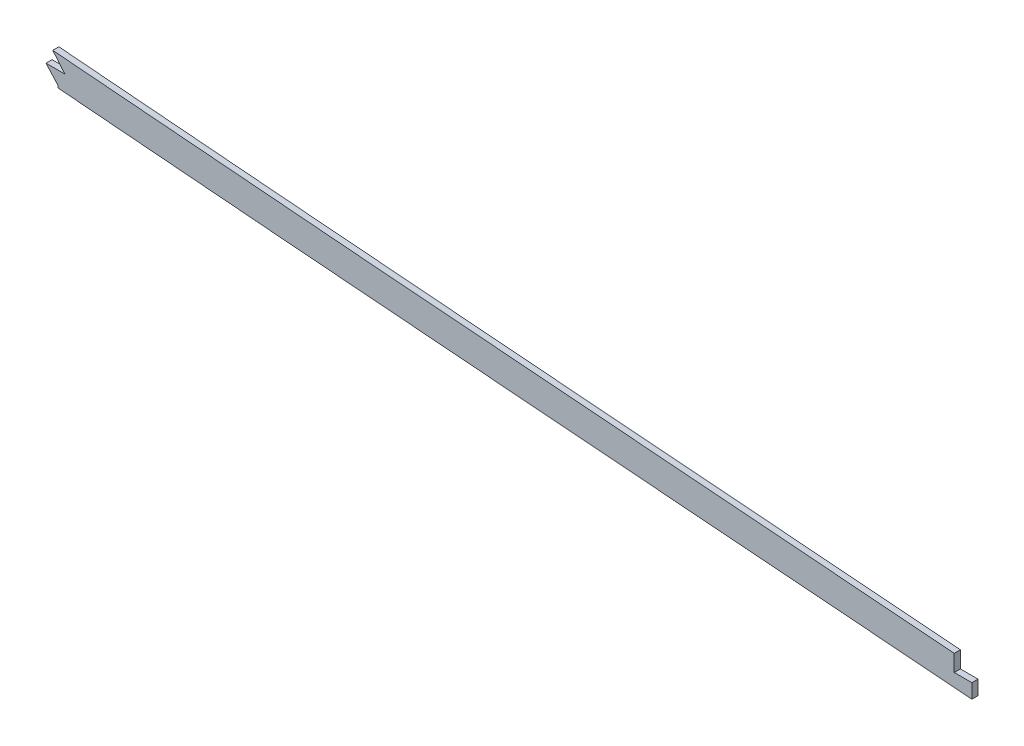
ISO-10303-21;
HEADER;
FILE_DESCRIPTION(('STEP AP214'),'2;1');
FILE_NAME('part.step','',(''),(''),'','','');
FILE_SCHEMA(('AUTOMOTIVE_DESIGN { 1 0 10303 214 1 1 1 1 }'));
ENDSEC;
DATA;
#1=APPLICATION_CONTEXT('core data for automotive mechanical design processes');
#2=APPLICATION_PROTOCOL_DEFINITION('international standard','automotive_design',2000,#1);
#3=PRODUCT_CONTEXT('',#1,'mechanical');
#4=PRODUCT('Part','Part','',(#3));
#5=PRODUCT_RELATED_PRODUCT_CATEGORY('part','',(#4));
#6=PRODUCT_DEFINITION_FORMATION('','',#4);
#7=PRODUCT_DEFINITION_CONTEXT('part definition',#1,'design');
#8=PRODUCT_DEFINITION('design','',#6,#7);
#9=PRODUCT_DEFINITION_SHAPE('','',#8);
#10=(LENGTH_UNIT() NAMED_UNIT(*) SI_UNIT(.MILLI.,.METRE.));
#11=(NAMED_UNIT(*) PLANE_ANGLE_UNIT() SI_UNIT($,.RADIAN.));
#12=(NAMED_UNIT(*) SI_UNIT($,.STERADIAN.) SOLID_ANGLE_UNIT());
#13=UNCERTAINTY_MEASURE_WITH_UNIT(LENGTH_MEASURE(1.E-05),#10,'distance_accuracy_value','');
#14=(GEOMETRIC_REPRESENTATION_CONTEXT(3) GLOBAL_UNCERTAINTY_ASSIGNED_CONTEXT((#13)) GLOBAL_UNIT_ASSIGNED_CONTEXT((#10,
#11,#12)) REPRESENTATION_CONTEXT('',''));
#15=CARTESIAN_POINT('',(0.,0.,0.));
#16=DIRECTION('',(0.,0.,1.));
#17=DIRECTION('',(1.,0.,0.));
#18=AXIS2_PLACEMENT_3D('',#15,#16,#17);
#19=CARTESIAN_POINT('',(818.067033698442,264.706491743222,1.5875));
#20=CARTESIAN_POINT('',(827.043059883077,263.499182154688,1.5875));
#21=CARTESIAN_POINT('',(836.029088262746,262.37336018535,1.5875));
#22=CARTESIAN_POINT('',(845.086758911477,261.305822737124,1.5875));
#23=CARTESIAN_POINT('',(891.386485356828,256.087047064925,1.5875));
#24=CARTESIAN_POINT('',(937.686211733138,251.779150949417,1.5875));
#25=CARTESIAN_POINT('',(973.452075064018,248.227669424888,1.5875));
#26=CARTESIAN_POINT('',(1071.94667214103,239.051054037575,1.5875));
#27=CARTESIAN_POINT('',(1170.4412693194,229.731506737662,1.5875));
#28=CARTESIAN_POINT('',(1231.79194034372,224.503945812963,1.5875));
#29=CARTESIAN_POINT('',(1324.89933614602,216.790627817024,1.5875));
#30=CARTESIAN_POINT('',(1418.00673093479,209.040117977579,1.5875));
#31=CARTESIAN_POINT('',(1449.7429359212,206.361809936344,1.5875));
#32=CARTESIAN_POINT('',(1636.92860677809,190.521130341518,1.5875));
#33=CARTESIAN_POINT('',(1824.11427763497,175.409157235081,1.5875));
#34=CARTESIAN_POINT('',(1979.96694737597,164.299650252625,1.5875));
#35=CARTESIAN_POINT('',(2156.26863942885,150.414433314205,1.5875));
#36=CARTESIAN_POINT('',(2332.5703304682,133.85721640186,1.5875));
#37=CARTESIAN_POINT('',(2354.21298315715,131.785082220072,1.5875));
#38=CARTESIAN_POINT('',(2436.3555443117,123.723952135345,1.5875));
#39=CARTESIAN_POINT('',(2518.49810546626,114.859112916573,1.5875));
#40=CARTESIAN_POINT('',(2579.48130742255,107.74251493933,1.5875));
#41=CARTESIAN_POINT('',(2639.63682069028,100.383443901382,1.5875));
#42=CARTESIAN_POINT('',(2699.79233294449,92.6044886503654,1.5875));
#43=(BOUNDED_CURVE() B_SPLINE_CURVE(5,(#19,#20,#21,#22,#23,#24,#25,#26,#27,#28,#29,#30,#31,#32,
#33,#34,#35,#36,#37,#38,#39,#40,#41,#42),.UNSPECIFIED.,.F.,.F.) B_SPLINE_CURVE_WITH_KNOTS((6,3,
3,3,3,3,3,6),(77.9308215150932,82.46579272,100.7932901,131.0989539,146.7691983,223.5339586,
233.9431167,264.2162088),
.UNSPECIFIED.) CURVE() GEOMETRIC_REPRESENTATION_ITEM() RATIONAL_B_SPLINE_CURVE((1.,1.,1.,1.,1.,
1.,1.,1.,1.,1.,1.,1.,1.,1.,1.,1.,1.,1.,1.,1.,1.,1.,1.,1.)) REPRESENTATION_ITEM(''));
#44=DIRECTION('',(0.,0.,-1.));
#45=VECTOR('',#44,1.);
#46=SURFACE_OF_LINEAR_EXTRUSION('',#43,#45);
#47=CARTESIAN_POINT('',(2021.30266391306,160.549504665463,-1.5875));
#48=CARTESIAN_POINT('',(1928.03284373415,167.933859366335,-1.5875));
#49=CARTESIAN_POINT('',(1834.7006365556,175.061132785407,-1.5875));
#50=CARTESIAN_POINT('',(1741.33816836239,182.245212549494,-1.5875));
#51=CARTESIAN_POINT('',(1648.05048687138,189.778800082756,-1.5875));
#52=CARTESIAN_POINT('',(1554.78174357075,197.536946322116,-1.5875));
#53=(BOUNDED_CURVE() B_SPLINE_CURVE(5,(#47,#48,#49,#50,#51,#52),.UNSPECIFIED.,.F.,
.F.) B_SPLINE_CURVE_WITH_KNOTS((6,6),(150.874983581795,196.930657229891),
.UNSPECIFIED.) CURVE() GEOMETRIC_REPRESENTATION_ITEM() RATIONAL_B_SPLINE_CURVE((1.,1.,1.,1.,1.,1.)) REPRESENTATION_ITEM(''));
#54=CARTESIAN_POINT('',(1554.78172827208,197.536981517301,-1.5875));
#55=VERTEX_POINT('',#54);
#56=CARTESIAN_POINT('',(2021.30263587561,160.548972334283,-1.5875));
#57=VERTEX_POINT('',#56);
#58=EDGE_CURVE('E251',#55,#57,#53,.F.);
#59=ORIENTED_EDGE('',*,*,#58,.F.);
#60=CARTESIAN_POINT('',(1554.78177425715,197.536943769604,-1.5875));
#61=DIRECTION('',(0.,0.,1.));
#62=VECTOR('',#61,1.);
#63=LINE('',#60,#62);
#64=CARTESIAN_POINT('',(1554.78174084528,197.536946932136,1.5875));
#65=VERTEX_POINT('',#64);
#66=EDGE_CURVE('E179',#55,#65,#63,.T.);
#67=ORIENTED_EDGE('',*,*,#66,.T.);
#68=CARTESIAN_POINT('',(1554.78174081361,197.536946551456,1.5875));
#69=CARTESIAN_POINT('',(1648.05048466555,189.77880026089,1.5875));
#70=CARTESIAN_POINT('',(1741.3381667071,182.245212676862,1.5875));
#71=CARTESIAN_POINT('',(1834.70063545299,175.061132869607,1.5875));
#72=CARTESIAN_POINT('',(1928.03284318404,167.933859409891,1.5875));
#73=CARTESIAN_POINT('',(2021.30266391472,160.549504665331,1.5875));
#74=(BOUNDED_CURVE() B_SPLINE_CURVE(5,(#68,#69,#70,#71,#72,#73),.UNSPECIFIED.,.F.,
.F.) B_SPLINE_CURVE_WITH_KNOTS((6,6),(150.874983309503,196.930657230055),
.UNSPECIFIED.) CURVE() GEOMETRIC_REPRESENTATION_ITEM() RATIONAL_B_SPLINE_CURVE((1.,1.,1.,1.,1.,1.)) REPRESENTATION_ITEM(''));
#75=CARTESIAN_POINT('',(2021.3026358767,160.549150542046,1.5875));
#76=VERTEX_POINT('',#75);
#77=EDGE_CURVE('E245',#65,#76,#74,.T.);
#78=ORIENTED_EDGE('',*,*,#77,.T.);
#79=DIRECTION('',(0.,0.,-1.));
#80=VECTOR('',#79,1.);
#81=CARTESIAN_POINT('',(2021.3026358767,160.549506885156,1.5875));
#82=LINE('',#81,#80);
#83=EDGE_CURVE('E150',#57,#76,#82,.F.);
#84=ORIENTED_EDGE('',*,*,#83,.F.);
#85=EDGE_LOOP('',(#59,#67,#78,#84));
#86=FACE_BOUND('',#85,.T.);
#87=ADVANCED_FACE('F40',(#86),#46,.T.);
#88=CARTESIAN_POINT('',(0.,0.,1.5875));
#89=DIRECTION('',(0.,0.,1.));
#90=DIRECTION('',(1.,0.,0.));
#91=AXIS2_PLACEMENT_3D('',#88,#89,#90);
#92=PLANE('',#91);
#93=ORIENTED_EDGE('',*,*,#77,.F.);
#94=DIRECTION('',(0.645331605709328,-0.7639025583624,0.));
#95=VECTOR('',#94,1.);
#96=CARTESIAN_POINT('',(1554.7817129433,197.537016350415,1.5875));
#97=LINE('',#96,#95);
#98=CARTESIAN_POINT('',(1561.12421043873,190.029170740031,1.5875));
#99=VERTEX_POINT('',#98);
#100=EDGE_CURVE('E124',#65,#99,#97,.T.);
#101=ORIENTED_EDGE('',*,*,#100,.T.);
#102=DIRECTION('',(-1.,0.,0.));
#103=VECTOR('',#102,1.);
#104=CARTESIAN_POINT('',(1561.12421043873,190.029170740031,1.5875));
#105=LINE('',#104,#103);
#106=CARTESIAN_POINT('',(1551.31180898219,190.029170740031,1.5875));
#107=VERTEX_POINT('',#106);
#108=EDGE_CURVE('E141',#99,#107,#105,.T.);
#109=ORIENTED_EDGE('',*,*,#108,.T.);
#110=DIRECTION('',(0.670744430287446,-0.741688552721673,0.));
#111=VECTOR('',#110,1.);
#112=CARTESIAN_POINT('',(1551.31180898219,190.029170740031,1.5875));
#113=LINE('',#112,#111);
#114=CARTESIAN_POINT('',(1557.61112843577,183.06357711347,1.5875));
#115=VERTEX_POINT('',#114);
#116=EDGE_CURVE('E117',#107,#115,#113,.T.);
#117=ORIENTED_EDGE('',*,*,#116,.T.);
#118=DIRECTION('',(0.178679549013381,0.9839073222435,0.));
#119=VECTOR('',#118,1.);
#120=CARTESIAN_POINT('',(1556.64382370832,177.737068235235,1.5875));
#121=LINE('',#120,#119);
#122=CARTESIAN_POINT('',(1557.42263287791,182.025617477836,1.5875));
#123=VERTEX_POINT('',#122);
#124=EDGE_CURVE('E127',#123,#115,#121,.T.);
#125=ORIENTED_EDGE('',*,*,#124,.F.);
#126=CARTESIAN_POINT('',(816.035490090419,249.602504502473,1.5875));
#127=CARTESIAN_POINT('',(820.895958915978,248.948752998504,1.5875));
#128=CARTESIAN_POINT('',(830.611237516535,247.699685180795,1.5875));
#129=CARTESIAN_POINT('',(845.281067269815,245.953419482549,1.5875));
#130=CARTESIAN_POINT('',(860.086531547022,244.295598067093,1.5875));
#131=CARTESIAN_POINT('',(879.83070343434,242.186646027517,1.5875));
#132=CARTESIAN_POINT('',(904.36996709185,239.698279805688,1.5875));
#133=CARTESIAN_POINT('',(933.571022669327,236.832150625483,1.5875));
#134=CARTESIAN_POINT('',(962.642718040815,234.023667740898,1.5875));
#135=CARTESIAN_POINT('',(991.762593942944,231.241975908087,1.5875));
#136=CARTESIAN_POINT('',(1021.07201031471,228.475862291185,1.5875));
#137=CARTESIAN_POINT('',(1060.37643731472,224.796956681051,1.5875));
#138=CARTESIAN_POINT('',(1109.51301557685,220.18437886172,1.5875));
#139=CARTESIAN_POINT('',(1168.51119036116,214.817071985159,1.5875));
#140=CARTESIAN_POINT('',(1227.50012979269,209.662054041939,1.5875));
#141=CARTESIAN_POINT('',(1306.13316794657,203.021178328389,1.5875));
#142=CARTESIAN_POINT('',(1404.36147710547,194.920725932278,1.5875));
#143=CARTESIAN_POINT('',(1522.23985107062,184.918066624094,1.5875));
#144=CARTESIAN_POINT('',(1640.18285649102,175.16700778633,1.5875));
#145=CARTESIAN_POINT('',(1758.16535256682,165.7576394845,1.5875));
#146=CARTESIAN_POINT('',(1876.15538476943,156.590937078959,1.5875));
#147=CARTESIAN_POINT('',(1994.08749188002,147.453250142139,1.5875));
#148=CARTESIAN_POINT('',(2092.26869206097,139.624216053351,1.5875));
#149=CARTESIAN_POINT('',(2170.74802904205,133.07965672904,1.5875));
#150=CARTESIAN_POINT('',(2219.77173097685,128.842227835716,1.5875));
#151=CARTESIAN_POINT('',(2258.98398824696,125.347211495477,1.5875));
#152=CARTESIAN_POINT('',(2288.37945753647,122.670854497073,1.5875));
#153=CARTESIAN_POINT('',(2317.81224311603,119.931729386451,1.5875));
#154=CARTESIAN_POINT('',(2347.55150917161,117.100365282643,1.5875));
#155=CARTESIAN_POINT('',(2377.15989972739,114.210118529692,1.5875));
#156=CARTESIAN_POINT('',(2406.46965385077,111.268968010355,1.5875));
#157=CARTESIAN_POINT('',(2435.81832605954,108.240091266207,1.5875));
#158=CARTESIAN_POINT('',(2474.91392826886,104.090158094027,1.5875));
#159=CARTESIAN_POINT('',(2523.71623221738,98.6932837654834,1.5875));
#160=CARTESIAN_POINT('',(2582.04188116328,91.9122953054182,1.5875));
#161=CARTESIAN_POINT('',(2640.07521554125,84.8575618799937,1.5875));
#162=CARTESIAN_POINT('',(2678.57418525121,79.9813997136137,1.5875));
#163=CARTESIAN_POINT('',(2697.83785996013,77.4903351724698,1.5875));
#164=B_SPLINE_CURVE_WITH_KNOTS('',3,(#126,#127,#128,#129,#130,#131,#132,#133,#134,#135,#136,
#137,#138,#139,#140,#141,#142,#143,#144,#145,#146,#147,#148,#149,#150,#151,#152,#153,#154,#155,
#156,#157,#158,#159,#160,#161,#162,#163),.UNSPECIFIED.,.F.,.F.,(4,1,1,1,1,1,1,1,1,1,1,1,1,1,1,1,
1,1,1,1,1,1,1,1,1,1,1,1,1,1,1,1,1,1,1,4),(77.9308215150932,79.3861761032565,80.8415306914199,
82.2968852795832,83.7522398677466,86.6629490440732,89.5736582203999,92.4843673967266,
95.3950765730532,98.3057857493799,101.216494925707,107.03791327836,112.859331631013,
118.680749983667,124.50216833632,136.145005041627,147.787841746933,159.43067845224,
171.073515157547,182.716351862853,194.35918856816,206.002025273467,211.82344362612,
217.644861978773,220.5555711551,223.466280331427,226.376989507753,229.28769868408,
232.198407860407,235.109117036733,238.01982621306,240.930535389387,246.75195374204,
252.573372094693,258.394790447347,264.2162088),.UNSPECIFIED.);
#165=CARTESIAN_POINT('',(2030.42896588334,144.537877354903,1.5875));
#166=VERTEX_POINT('',#165);
#167=EDGE_CURVE('E187',#123,#166,#164,.T.);
#168=ORIENTED_EDGE('',*,*,#167,.T.);
#169=DIRECTION('',(0.,-1.,0.));
#170=VECTOR('',#169,1.);
#171=CARTESIAN_POINT('',(2030.42896588334,151.973195801504,1.5875));
#172=LINE('',#171,#170);
#173=CARTESIAN_POINT('',(2030.42896588334,151.973195801504,1.5875));
#174=VERTEX_POINT('',#173);
#175=EDGE_CURVE('E135',#174,#166,#172,.T.);
#176=ORIENTED_EDGE('',*,*,#175,.F.);
#177=DIRECTION('',(1.,0.,0.));
#178=VECTOR('',#177,1.);
#179=CARTESIAN_POINT('',(2021.3026358767,151.973195801504,1.5875));
#180=LINE('',#179,#178);
#181=CARTESIAN_POINT('',(2021.3026358767,151.973195801504,1.5875));
#182=VERTEX_POINT('',#181);
#183=EDGE_CURVE('E161',#182,#174,#180,.T.);
#184=ORIENTED_EDGE('',*,*,#183,.F.);
#185=DIRECTION('',(0.,-1.,0.));
#186=VECTOR('',#185,1.);
#187=CARTESIAN_POINT('',(2021.3026358767,160.549539386168,1.5875));
#188=LINE('',#187,#186);
#189=EDGE_CURVE('E158',#76,#182,#188,.T.);
#190=ORIENTED_EDGE('',*,*,#189,.F.);
#191=EDGE_LOOP('',(#93,#101,#109,#117,#125,#168,#176,#184,#190));
#192=FACE_BOUND('',#191,.T.);
#193=ADVANCED_FACE('F138',(#192),#92,.T.);
#194=CARTESIAN_POINT('',(0.,0.,-1.5875));
#195=DIRECTION('',(0.,0.,1.));
#196=DIRECTION('',(1.,0.,0.));
#197=AXIS2_PLACEMENT_3D('',#194,#195,#196);
#198=PLANE('',#197);
#199=DIRECTION('',(0.645331605709328,-0.7639025583624,0.));
#200=VECTOR('',#199,1.);
#201=CARTESIAN_POINT('',(1004.66830347762,848.726322999037,-1.5875));
#202=LINE('',#201,#200);
#203=CARTESIAN_POINT('',(1561.12421043873,190.029170740031,-1.5875));
#204=VERTEX_POINT('',#203);
#205=EDGE_CURVE('E11',#55,#204,#202,.T.);
#206=ORIENTED_EDGE('',*,*,#205,.F.);
#207=ORIENTED_EDGE('',*,*,#58,.T.);
#208=DIRECTION('',(0.,-1.,0.));
#209=VECTOR('',#208,1.);
#210=CARTESIAN_POINT('',(2021.3026358767,0.,-1.5875));
#211=LINE('',#210,#209);
#212=CARTESIAN_POINT('',(2021.3026358767,151.973195801504,-1.5875));
#213=VERTEX_POINT('',#212);
#214=EDGE_CURVE('E284',#57,#213,#211,.T.);
#215=ORIENTED_EDGE('',*,*,#214,.T.);
#216=DIRECTION('',(1.,0.,0.));
#217=VECTOR('',#216,1.);
#218=CARTESIAN_POINT('',(0.,151.973195801504,-1.5875));
#219=LINE('',#218,#217);
#220=CARTESIAN_POINT('',(2030.42896588334,151.973195801504,-1.5875));
#221=VERTEX_POINT('',#220);
#222=EDGE_CURVE('E288',#213,#221,#219,.T.);
#223=ORIENTED_EDGE('',*,*,#222,.T.);
#224=DIRECTION('',(0.,-1.,0.));
#225=VECTOR('',#224,1.);
#226=CARTESIAN_POINT('',(2030.42896588334,0.,-1.5875));
#227=LINE('',#226,#225);
#228=CARTESIAN_POINT('',(2030.42896588334,144.537877354903,-1.5875));
#229=VERTEX_POINT('',#228);
#230=EDGE_CURVE('E294',#221,#229,#227,.T.);
#231=ORIENTED_EDGE('',*,*,#230,.T.);
#232=CARTESIAN_POINT('',(816.035490090419,249.602504502473,-1.5875));
#233=CARTESIAN_POINT('',(820.895958915978,248.948752998504,-1.5875));
#234=CARTESIAN_POINT('',(830.611237516535,247.699685180795,-1.5875));
#235=CARTESIAN_POINT('',(845.281067269815,245.953419482549,-1.5875));
#236=CARTESIAN_POINT('',(860.086531547022,244.295598067093,-1.5875));
#237=CARTESIAN_POINT('',(879.83070343434,242.186646027517,-1.5875));
#238=CARTESIAN_POINT('',(904.36996709185,239.698279805688,-1.5875));
#239=CARTESIAN_POINT('',(933.571022669327,236.832150625483,-1.5875));
#240=CARTESIAN_POINT('',(962.642718040815,234.023667740898,-1.5875));
#241=CARTESIAN_POINT('',(991.762593942944,231.241975908087,-1.5875));
#242=CARTESIAN_POINT('',(1021.07201031471,228.475862291185,-1.5875));
#243=CARTESIAN_POINT('',(1060.37643731472,224.796956681051,-1.5875));
#244=CARTESIAN_POINT('',(1109.51301557685,220.18437886172,-1.5875));
#245=CARTESIAN_POINT('',(1168.51119036116,214.817071985159,-1.5875));
#246=CARTESIAN_POINT('',(1227.50012979269,209.662054041939,-1.5875));
#247=CARTESIAN_POINT('',(1306.13316794657,203.021178328389,-1.5875));
#248=CARTESIAN_POINT('',(1404.36147710547,194.920725932278,-1.5875));
#249=CARTESIAN_POINT('',(1522.23985107062,184.918066624094,-1.5875));
#250=CARTESIAN_POINT('',(1640.18285649102,175.16700778633,-1.5875));
#251=CARTESIAN_POINT('',(1758.16535256682,165.7576394845,-1.5875));
#252=CARTESIAN_POINT('',(1876.15538476943,156.590937078959,-1.5875));
#253=CARTESIAN_POINT('',(1994.08749188002,147.453250142139,-1.5875));
#254=CARTESIAN_POINT('',(2092.26869206097,139.624216053351,-1.5875));
#255=CARTESIAN_POINT('',(2170.74802904205,133.07965672904,-1.5875));
#256=CARTESIAN_POINT('',(2219.77173097685,128.842227835716,-1.5875));
#257=CARTESIAN_POINT('',(2258.98398824696,125.347211495477,-1.5875));
#258=CARTESIAN_POINT('',(2288.37945753647,122.670854497073,-1.5875));
#259=CARTESIAN_POINT('',(2317.81224311603,119.931729386451,-1.5875));
#260=CARTESIAN_POINT('',(2347.55150917161,117.100365282643,-1.5875));
#261=CARTESIAN_POINT('',(2377.15989972739,114.210118529692,-1.5875));
#262=CARTESIAN_POINT('',(2406.46965385077,111.268968010355,-1.5875));
#263=CARTESIAN_POINT('',(2435.81832605954,108.240091266207,-1.5875));
#264=CARTESIAN_POINT('',(2474.91392826886,104.090158094027,-1.5875));
#265=CARTESIAN_POINT('',(2523.71623221738,98.6932837654834,-1.5875));
#266=CARTESIAN_POINT('',(2582.04188116328,91.9122953054182,-1.5875));
#267=CARTESIAN_POINT('',(2640.07521554125,84.8575618799937,-1.5875));
#268=CARTESIAN_POINT('',(2678.57418525121,79.9813997136137,-1.5875));
#269=CARTESIAN_POINT('',(2697.83785996013,77.4903351724698,-1.5875));
#270=B_SPLINE_CURVE_WITH_KNOTS('',3,(#232,#233,#234,#235,#236,#237,#238,#239,#240,#241,#242,
#243,#244,#245,#246,#247,#248,#249,#250,#251,#252,#253,#254,#255,#256,#257,#258,#259,#260,#261,
#262,#263,#264,#265,#266,#267,#268,#269),.UNSPECIFIED.,.F.,.F.,(4,1,1,1,1,1,1,1,1,1,1,1,1,1,1,1,
1,1,1,1,1,1,1,1,1,1,1,1,1,1,1,1,1,1,1,4),(77.9308215150932,79.3861761032565,80.8415306914199,
82.2968852795832,83.7522398677466,86.6629490440732,89.5736582203999,92.4843673967266,
95.3950765730532,98.3057857493799,101.216494925707,107.03791327836,112.859331631013,
118.680749983667,124.50216833632,136.145005041627,147.787841746933,159.43067845224,
171.073515157547,182.716351862853,194.35918856816,206.002025273467,211.82344362612,
217.644861978773,220.5555711551,223.466280331427,226.376989507753,229.28769868408,
232.198407860407,235.109117036733,238.01982621306,240.930535389387,246.75195374204,
252.573372094693,258.394790447347,264.2162088),.UNSPECIFIED.);
#271=CARTESIAN_POINT('',(1557.42263287791,182.025617477836,-1.5875));
#272=VERTEX_POINT('',#271);
#273=EDGE_CURVE('E254',#272,#229,#270,.T.);
#274=ORIENTED_EDGE('',*,*,#273,.F.);
#275=DIRECTION('',(0.178679549013381,0.9839073222435,0.));
#276=VECTOR('',#275,1.);
#277=CARTESIAN_POINT('',(1475.69891127468,-267.98989090239,-1.5875));
#278=LINE('',#277,#276);
#279=CARTESIAN_POINT('',(1557.61112843577,183.06357711347,-1.5875));
#280=VERTEX_POINT('',#279);
#281=EDGE_CURVE('E298',#272,#280,#278,.T.);
#282=ORIENTED_EDGE('',*,*,#281,.T.);
#283=DIRECTION('',(0.670744430287446,-0.741688552721673,0.));
#284=VECTOR('',#283,1.);
#285=CARTESIAN_POINT('',(947.915958397723,857.24573629014,-1.5875));
#286=LINE('',#285,#284);
#287=CARTESIAN_POINT('',(1551.31180898219,190.029170740031,-1.5875));
#288=VERTEX_POINT('',#287);
#289=EDGE_CURVE('E120',#288,#280,#286,.T.);
#290=ORIENTED_EDGE('',*,*,#289,.F.);
#291=DIRECTION('',(-1.,0.,0.));
#292=VECTOR('',#291,1.);
#293=CARTESIAN_POINT('',(0.,190.029170740031,-1.5875));
#294=LINE('',#293,#292);
#295=EDGE_CURVE('E52',#204,#288,#294,.T.);
#296=ORIENTED_EDGE('',*,*,#295,.F.);
#297=EDGE_LOOP('',(#206,#207,#215,#223,#231,#274,#282,#290,#296));
#298=FACE_BOUND('',#297,.T.);
#299=ADVANCED_FACE('F223',(#298),#198,.F.);
#300=DIRECTION('',(0.,0.,-1.));
#301=VECTOR('',#300,1.);
#302=SURFACE_OF_LINEAR_EXTRUSION('',#164,#301);
#303=ORIENTED_EDGE('',*,*,#167,.F.);
#304=DIRECTION('',(0.,0.,-1.));
#305=VECTOR('',#304,1.);
#306=CARTESIAN_POINT('',(1557.42263287776,182.02561747698,1.5875));
#307=LINE('',#306,#305);
#308=EDGE_CURVE('E130',#123,#272,#307,.T.);
#309=ORIENTED_EDGE('',*,*,#308,.T.);
#310=ORIENTED_EDGE('',*,*,#273,.T.);
#311=DIRECTION('',(0.,0.,-1.));
#312=VECTOR('',#311,1.);
#313=CARTESIAN_POINT('',(2030.42896588334,144.537877355303,1.5875));
#314=LINE('',#313,#312);
#315=EDGE_CURVE('E171',#229,#166,#314,.F.);
#316=ORIENTED_EDGE('',*,*,#315,.T.);
#317=EDGE_LOOP('',(#303,#309,#310,#316));
#318=FACE_BOUND('',#317,.T.);
#319=ADVANCED_FACE('F42',(#318),#302,.F.);
#320=CARTESIAN_POINT('',(2030.42896588334,151.973195801504,-6.0325));
#321=DIRECTION('',(-1.,0.,0.));
#322=DIRECTION('',(0.,0.,1.));
#323=AXIS2_PLACEMENT_3D('',#320,#321,#322);
#324=PLANE('',#323);
#325=ORIENTED_EDGE('',*,*,#230,.F.);
#326=DIRECTION('',(0.,0.,1.));
#327=VECTOR('',#326,1.);
#328=CARTESIAN_POINT('',(2030.42896588334,151.973195801504,-6.0325));
#329=LINE('',#328,#327);
#330=EDGE_CURVE('E153',#221,#174,#329,.T.);
#331=ORIENTED_EDGE('',*,*,#330,.T.);
#332=ORIENTED_EDGE('',*,*,#175,.T.);
#333=ORIENTED_EDGE('',*,*,#315,.F.);
#334=EDGE_LOOP('',(#325,#331,#332,#333));
#335=FACE_BOUND('',#334,.T.);
#336=ADVANCED_FACE('F210',(#335),#324,.F.);
#337=CARTESIAN_POINT('',(2021.3026358767,151.973195801504,-6.0325));
#338=DIRECTION('',(0.,-1.,0.));
#339=DIRECTION('',(0.,0.,-1.));
#340=AXIS2_PLACEMENT_3D('',#337,#338,#339);
#341=PLANE('',#340);
#342=DIRECTION('',(0.,0.,1.));
#343=VECTOR('',#342,1.);
#344=CARTESIAN_POINT('',(2021.3026358767,151.973195801504,-6.0325));
#345=LINE('',#344,#343);
#346=EDGE_CURVE('E68',#213,#182,#345,.T.);
#347=ORIENTED_EDGE('',*,*,#346,.T.);
#348=ORIENTED_EDGE('',*,*,#183,.T.);
#349=ORIENTED_EDGE('',*,*,#330,.F.);
#350=ORIENTED_EDGE('',*,*,#222,.F.);
#351=EDGE_LOOP('',(#347,#348,#349,#350));
#352=FACE_BOUND('',#351,.T.);
#353=ADVANCED_FACE('F213',(#352),#341,.F.);
#354=CARTESIAN_POINT('',(2021.3026358767,160.549539386168,-6.0325));
#355=DIRECTION('',(-1.,0.,0.));
#356=DIRECTION('',(0.,0.,1.));
#357=AXIS2_PLACEMENT_3D('',#354,#355,#356);
#358=PLANE('',#357);
#359=ORIENTED_EDGE('',*,*,#83,.T.);
#360=ORIENTED_EDGE('',*,*,#189,.T.);
#361=ORIENTED_EDGE('',*,*,#346,.F.);
#362=ORIENTED_EDGE('',*,*,#214,.F.);
#363=EDGE_LOOP('',(#359,#360,#361,#362));
#364=FACE_BOUND('',#363,.T.);
#365=ADVANCED_FACE('F202',(#364),#358,.F.);
#366=CARTESIAN_POINT('',(1554.7817129433,197.537016350415,-6.0325));
#367=DIRECTION('',(-0.7639025583624,-0.645331605709328,0.));
#368=DIRECTION('',(0.645331605709328,-0.7639025583624,0.));
#369=AXIS2_PLACEMENT_3D('',#366,#367,#368);
#370=PLANE('',#369);
#371=ORIENTED_EDGE('',*,*,#205,.T.);
#372=DIRECTION('',(0.,0.,1.));
#373=VECTOR('',#372,1.);
#374=CARTESIAN_POINT('',(1561.12421043873,190.029170740031,-6.0325));
#375=LINE('',#374,#373);
#376=EDGE_CURVE('E147',#204,#99,#375,.T.);
#377=ORIENTED_EDGE('',*,*,#376,.T.);
#378=ORIENTED_EDGE('',*,*,#100,.F.);
#379=ORIENTED_EDGE('',*,*,#66,.F.);
#380=EDGE_LOOP('',(#371,#377,#378,#379));
#381=FACE_BOUND('',#380,.T.);
#382=ADVANCED_FACE('F192',(#381),#370,.T.);
#383=CARTESIAN_POINT('',(1561.12421043873,190.029170740031,-6.0325));
#384=DIRECTION('',(0.,1.,0.));
#385=DIRECTION('',(0.,0.,1.));
#386=AXIS2_PLACEMENT_3D('',#383,#384,#385);
#387=PLANE('',#386);
#388=ORIENTED_EDGE('',*,*,#295,.T.);
#389=DIRECTION('',(0.,0.,1.));
#390=VECTOR('',#389,1.);
#391=CARTESIAN_POINT('',(1551.31180898219,190.029170740031,-6.0325));
#392=LINE('',#391,#390);
#393=EDGE_CURVE('E123',#288,#107,#392,.T.);
#394=ORIENTED_EDGE('',*,*,#393,.T.);
#395=ORIENTED_EDGE('',*,*,#108,.F.);
#396=ORIENTED_EDGE('',*,*,#376,.F.);
#397=EDGE_LOOP('',(#388,#394,#395,#396));
#398=FACE_BOUND('',#397,.T.);
#399=ADVANCED_FACE('F201',(#398),#387,.T.);
#400=CARTESIAN_POINT('',(1551.31180898219,190.029170740031,-6.0325));
#401=DIRECTION('',(-0.741688552721673,-0.670744430287446,0.));
#402=DIRECTION('',(0.670744430287446,-0.741688552721673,0.));
#403=AXIS2_PLACEMENT_3D('',#400,#401,#402);
#404=PLANE('',#403);
#405=ORIENTED_EDGE('',*,*,#289,.T.);
#406=DIRECTION('',(0.,0.,1.));
#407=VECTOR('',#406,1.);
#408=CARTESIAN_POINT('',(1557.61112843577,183.06357711347,-6.0325));
#409=LINE('',#408,#407);
#410=EDGE_CURVE('E60',#280,#115,#409,.T.);
#411=ORIENTED_EDGE('',*,*,#410,.T.);
#412=ORIENTED_EDGE('',*,*,#116,.F.);
#413=ORIENTED_EDGE('',*,*,#393,.F.);
#414=EDGE_LOOP('',(#405,#411,#412,#413));
#415=FACE_BOUND('',#414,.T.);
#416=ADVANCED_FACE('F114',(#415),#404,.T.);
#417=CARTESIAN_POINT('',(1556.64382370832,177.737068235235,-6.0325));
#418=DIRECTION('',(0.9839073222435,-0.178679549013381,0.));
#419=DIRECTION('',(0.178679549013381,0.9839073222435,0.));
#420=AXIS2_PLACEMENT_3D('',#417,#418,#419);
#421=PLANE('',#420);
#422=ORIENTED_EDGE('',*,*,#124,.T.);
#423=ORIENTED_EDGE('',*,*,#410,.F.);
#424=ORIENTED_EDGE('',*,*,#281,.F.);
#425=ORIENTED_EDGE('',*,*,#308,.F.);
#426=EDGE_LOOP('',(#422,#423,#424,#425));
#427=FACE_BOUND('',#426,.T.);
#428=ADVANCED_FACE('F128',(#427),#421,.F.);
#429=CLOSED_SHELL('',(#87,#193,#299,#319,#336,#353,#365,#382,#399,#416,#428));
#430=MANIFOLD_SOLID_BREP('B2',#429);
#431=ADVANCED_BREP_SHAPE_REPRESENTATION('',(#18,#430),#14);
#432=SHAPE_DEFINITION_REPRESENTATION(#9,#431);
ENDSEC;
END-ISO-10303-21;
